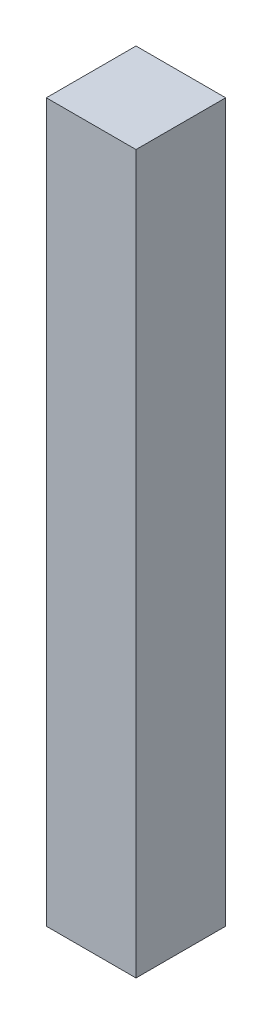
ISO-10303-21;
HEADER;
FILE_DESCRIPTION(('STEP AP214'),'2;1');
FILE_NAME('part.step','',(''),(''),'','','');
FILE_SCHEMA(('AUTOMOTIVE_DESIGN { 1 0 10303 214 1 1 1 1 }'));
ENDSEC;
DATA;
#1=APPLICATION_CONTEXT('core data for automotive mechanical design processes');
#2=APPLICATION_PROTOCOL_DEFINITION('international standard','automotive_design',2000,#1);
#3=PRODUCT_CONTEXT('',#1,'mechanical');
#4=PRODUCT('Part','Part','',(#3));
#5=PRODUCT_RELATED_PRODUCT_CATEGORY('part','',(#4));
#6=PRODUCT_DEFINITION_FORMATION('','',#4);
#7=PRODUCT_DEFINITION_CONTEXT('part definition',#1,'design');
#8=PRODUCT_DEFINITION('design','',#6,#7);
#9=PRODUCT_DEFINITION_SHAPE('','',#8);
#10=(LENGTH_UNIT() NAMED_UNIT(*) SI_UNIT(.MILLI.,.METRE.));
#11=(NAMED_UNIT(*) PLANE_ANGLE_UNIT() SI_UNIT($,.RADIAN.));
#12=(NAMED_UNIT(*) SI_UNIT($,.STERADIAN.) SOLID_ANGLE_UNIT());
#13=UNCERTAINTY_MEASURE_WITH_UNIT(LENGTH_MEASURE(1.E-05),#10,'distance_accuracy_value','');
#14=(GEOMETRIC_REPRESENTATION_CONTEXT(3) GLOBAL_UNCERTAINTY_ASSIGNED_CONTEXT((#13)) GLOBAL_UNIT_ASSIGNED_CONTEXT((#10,
#11,#12)) REPRESENTATION_CONTEXT('',''));
#15=CARTESIAN_POINT('',(0.,0.,0.));
#16=DIRECTION('',(0.,0.,1.));
#17=DIRECTION('',(1.,0.,0.));
#18=AXIS2_PLACEMENT_3D('',#15,#16,#17);
#19=CARTESIAN_POINT('',(1.5875,-12.70254,3.175));
#20=DIRECTION('',(-1.,0.,0.));
#21=DIRECTION('',(0.,0.,1.));
#22=AXIS2_PLACEMENT_3D('',#19,#20,#21);
#23=PLANE('',#22);
#24=DIRECTION('',(0.,1.,0.));
#25=VECTOR('',#24,1.);
#26=CARTESIAN_POINT('',(1.5875,-12.70254,0.));
#27=LINE('',#26,#25);
#28=CARTESIAN_POINT('',(1.5875,-12.70254,0.));
#29=VERTEX_POINT('',#28);
#30=CARTESIAN_POINT('',(1.5875,12.70254,0.));
#31=VERTEX_POINT('',#30);
#32=EDGE_CURVE('E103',#29,#31,#27,.T.);
#33=ORIENTED_EDGE('',*,*,#32,.T.);
#34=DIRECTION('',(0.,0.,-1.));
#35=VECTOR('',#34,1.);
#36=CARTESIAN_POINT('',(1.5875,12.70254,3.175));
#37=LINE('',#36,#35);
#38=CARTESIAN_POINT('',(1.5875,12.70254,3.175));
#39=VERTEX_POINT('',#38);
#40=EDGE_CURVE('E11',#39,#31,#37,.T.);
#41=ORIENTED_EDGE('',*,*,#40,.F.);
#42=DIRECTION('',(0.,1.,0.));
#43=VECTOR('',#42,1.);
#44=CARTESIAN_POINT('',(1.5875,-12.70254,3.175));
#45=LINE('',#44,#43);
#46=CARTESIAN_POINT('',(1.5875,-12.70254,3.175));
#47=VERTEX_POINT('',#46);
#48=EDGE_CURVE('E91',#47,#39,#45,.T.);
#49=ORIENTED_EDGE('',*,*,#48,.F.);
#50=DIRECTION('',(0.,0.,-1.));
#51=VECTOR('',#50,1.);
#52=CARTESIAN_POINT('',(1.5875,-12.70254,3.175));
#53=LINE('',#52,#51);
#54=EDGE_CURVE('E99',#47,#29,#53,.T.);
#55=ORIENTED_EDGE('',*,*,#54,.T.);
#56=EDGE_LOOP('',(#33,#41,#49,#55));
#57=FACE_BOUND('',#56,.T.);
#58=ADVANCED_FACE('F40',(#57),#23,.F.);
#59=CARTESIAN_POINT('',(-1.5875,12.70254,3.175));
#60=DIRECTION('',(0.,-1.,0.));
#61=DIRECTION('',(0.,0.,-1.));
#62=AXIS2_PLACEMENT_3D('',#59,#60,#61);
#63=PLANE('',#62);
#64=DIRECTION('',(-1.,0.,0.));
#65=VECTOR('',#64,1.);
#66=CARTESIAN_POINT('',(-1.5875,12.70254,0.));
#67=LINE('',#66,#65);
#68=CARTESIAN_POINT('',(-1.5875,12.70254,0.));
#69=VERTEX_POINT('',#68);
#70=EDGE_CURVE('E95',#31,#69,#67,.T.);
#71=ORIENTED_EDGE('',*,*,#70,.T.);
#72=DIRECTION('',(0.,0.,-1.));
#73=VECTOR('',#72,1.);
#74=CARTESIAN_POINT('',(-1.5875,12.70254,3.175));
#75=LINE('',#74,#73);
#76=CARTESIAN_POINT('',(-1.5875,12.70254,3.175));
#77=VERTEX_POINT('',#76);
#78=EDGE_CURVE('E48',#77,#69,#75,.T.);
#79=ORIENTED_EDGE('',*,*,#78,.F.);
#80=DIRECTION('',(-1.,0.,0.));
#81=VECTOR('',#80,1.);
#82=CARTESIAN_POINT('',(-1.5875,12.70254,3.175));
#83=LINE('',#82,#81);
#84=EDGE_CURVE('E86',#39,#77,#83,.T.);
#85=ORIENTED_EDGE('',*,*,#84,.F.);
#86=ORIENTED_EDGE('',*,*,#40,.T.);
#87=EDGE_LOOP('',(#71,#79,#85,#86));
#88=FACE_BOUND('',#87,.T.);
#89=ADVANCED_FACE('F94',(#88),#63,.F.);
#90=CARTESIAN_POINT('',(-1.5875,-12.70254,3.175));
#91=DIRECTION('',(1.,0.,0.));
#92=DIRECTION('',(0.,0.,-1.));
#93=AXIS2_PLACEMENT_3D('',#90,#91,#92);
#94=PLANE('',#93);
#95=DIRECTION('',(0.,-1.,0.));
#96=VECTOR('',#95,1.);
#97=CARTESIAN_POINT('',(-1.5875,-12.70254,0.));
#98=LINE('',#97,#96);
#99=CARTESIAN_POINT('',(-1.5875,-12.70254,0.));
#100=VERTEX_POINT('',#99);
#101=EDGE_CURVE('E73',#69,#100,#98,.T.);
#102=ORIENTED_EDGE('',*,*,#101,.T.);
#103=DIRECTION('',(0.,0.,-1.));
#104=VECTOR('',#103,1.);
#105=CARTESIAN_POINT('',(-1.5875,-12.70254,3.175));
#106=LINE('',#105,#104);
#107=CARTESIAN_POINT('',(-1.5875,-12.70254,3.175));
#108=VERTEX_POINT('',#107);
#109=EDGE_CURVE('E96',#108,#100,#106,.T.);
#110=ORIENTED_EDGE('',*,*,#109,.F.);
#111=DIRECTION('',(0.,-1.,0.));
#112=VECTOR('',#111,1.);
#113=CARTESIAN_POINT('',(-1.5875,-12.70254,3.175));
#114=LINE('',#113,#112);
#115=EDGE_CURVE('E89',#77,#108,#114,.T.);
#116=ORIENTED_EDGE('',*,*,#115,.F.);
#117=ORIENTED_EDGE('',*,*,#78,.T.);
#118=EDGE_LOOP('',(#102,#110,#116,#117));
#119=FACE_BOUND('',#118,.T.);
#120=ADVANCED_FACE('F97',(#119),#94,.F.);
#121=CARTESIAN_POINT('',(-1.5875,-12.70254,3.175));
#122=DIRECTION('',(0.,1.,0.));
#123=DIRECTION('',(0.,0.,1.));
#124=AXIS2_PLACEMENT_3D('',#121,#122,#123);
#125=PLANE('',#124);
#126=DIRECTION('',(1.,0.,0.));
#127=VECTOR('',#126,1.);
#128=CARTESIAN_POINT('',(-1.5875,-12.70254,0.));
#129=LINE('',#128,#127);
#130=EDGE_CURVE('E79',#100,#29,#129,.T.);
#131=ORIENTED_EDGE('',*,*,#130,.T.);
#132=ORIENTED_EDGE('',*,*,#54,.F.);
#133=DIRECTION('',(1.,0.,0.));
#134=VECTOR('',#133,1.);
#135=CARTESIAN_POINT('',(-1.5875,-12.70254,3.175));
#136=LINE('',#135,#134);
#137=EDGE_CURVE('E56',#108,#47,#136,.T.);
#138=ORIENTED_EDGE('',*,*,#137,.F.);
#139=ORIENTED_EDGE('',*,*,#109,.T.);
#140=EDGE_LOOP('',(#131,#132,#138,#139));
#141=FACE_BOUND('',#140,.T.);
#142=ADVANCED_FACE('F110',(#141),#125,.F.);
#143=CARTESIAN_POINT('',(0.,0.,3.175));
#144=DIRECTION('',(0.,0.,-1.));
#145=DIRECTION('',(-1.,0.,0.));
#146=AXIS2_PLACEMENT_3D('',#143,#144,#145);
#147=PLANE('',#146);
#148=ORIENTED_EDGE('',*,*,#48,.T.);
#149=ORIENTED_EDGE('',*,*,#84,.T.);
#150=ORIENTED_EDGE('',*,*,#115,.T.);
#151=ORIENTED_EDGE('',*,*,#137,.T.);
#152=EDGE_LOOP('',(#148,#149,#150,#151));
#153=FACE_BOUND('',#152,.T.);
#154=ADVANCED_FACE('F87',(#153),#147,.F.);
#155=CARTESIAN_POINT('',(0.,0.,0.));
#156=DIRECTION('',(0.,0.,-1.));
#157=DIRECTION('',(-1.,0.,0.));
#158=AXIS2_PLACEMENT_3D('',#155,#156,#157);
#159=PLANE('',#158);
#160=ORIENTED_EDGE('',*,*,#32,.F.);
#161=ORIENTED_EDGE('',*,*,#130,.F.);
#162=ORIENTED_EDGE('',*,*,#101,.F.);
#163=ORIENTED_EDGE('',*,*,#70,.F.);
#164=EDGE_LOOP('',(#160,#161,#162,#163));
#165=FACE_BOUND('',#164,.T.);
#166=ADVANCED_FACE('F113',(#165),#159,.T.);
#167=CLOSED_SHELL('',(#58,#89,#120,#142,#154,#166));
#168=MANIFOLD_SOLID_BREP('B2',#167);
#169=ADVANCED_BREP_SHAPE_REPRESENTATION('',(#18,#168),#14);
#170=SHAPE_DEFINITION_REPRESENTATION(#9,#169);
ENDSEC;
END-ISO-10303-21;
